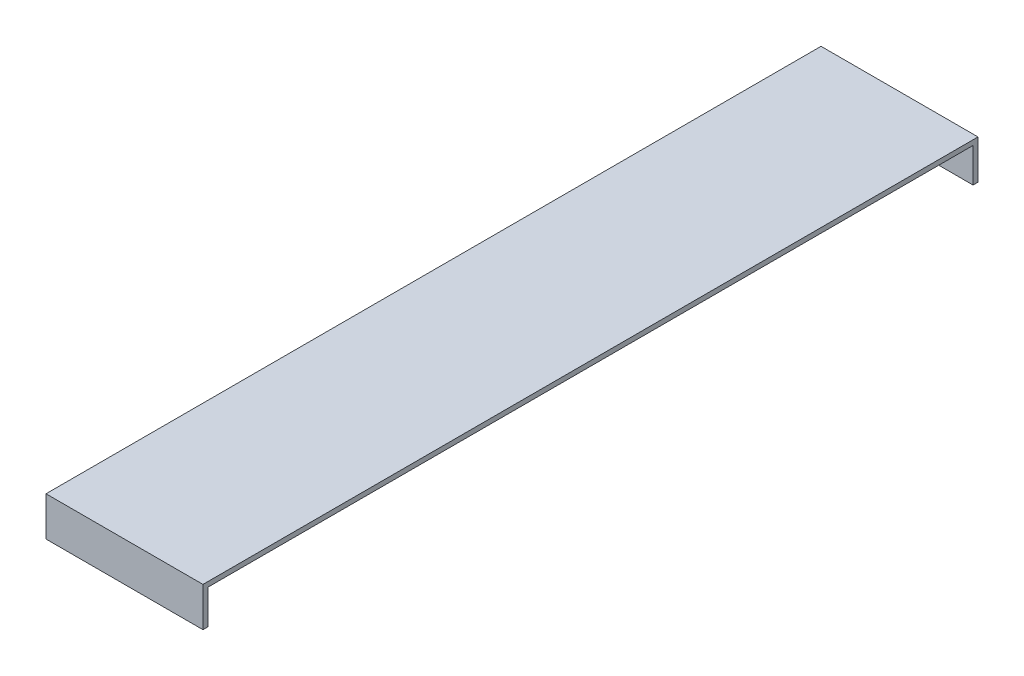
ISO-10303-21;
HEADER;
FILE_DESCRIPTION(('STEP AP214'),'2;1');
FILE_NAME('part.step','',(''),(''),'','','');
FILE_SCHEMA(('AUTOMOTIVE_DESIGN { 1 0 10303 214 1 1 1 1 }'));
ENDSEC;
DATA;
#1=APPLICATION_CONTEXT('core data for automotive mechanical design processes');
#2=APPLICATION_PROTOCOL_DEFINITION('international standard','automotive_design',2000,#1);
#3=PRODUCT_CONTEXT('',#1,'mechanical');
#4=PRODUCT('Part','Part','',(#3));
#5=PRODUCT_RELATED_PRODUCT_CATEGORY('part','',(#4));
#6=PRODUCT_DEFINITION_FORMATION('','',#4);
#7=PRODUCT_DEFINITION_CONTEXT('part definition',#1,'design');
#8=PRODUCT_DEFINITION('design','',#6,#7);
#9=PRODUCT_DEFINITION_SHAPE('','',#8);
#10=(LENGTH_UNIT() NAMED_UNIT(*) SI_UNIT(.MILLI.,.METRE.));
#11=(NAMED_UNIT(*) PLANE_ANGLE_UNIT() SI_UNIT($,.RADIAN.));
#12=(NAMED_UNIT(*) SI_UNIT($,.STERADIAN.) SOLID_ANGLE_UNIT());
#13=UNCERTAINTY_MEASURE_WITH_UNIT(LENGTH_MEASURE(1.E-05),#10,'distance_accuracy_value','');
#14=(GEOMETRIC_REPRESENTATION_CONTEXT(3) GLOBAL_UNCERTAINTY_ASSIGNED_CONTEXT((#13)) GLOBAL_UNIT_ASSIGNED_CONTEXT((#10,
#11,#12)) REPRESENTATION_CONTEXT('',''));
#15=CARTESIAN_POINT('',(0.,0.,0.));
#16=DIRECTION('',(0.,0.,1.));
#17=DIRECTION('',(1.,0.,0.));
#18=AXIS2_PLACEMENT_3D('',#15,#16,#17);
#19=CARTESIAN_POINT('',(101.6,0.,0.));
#20=DIRECTION('',(0.,0.,-1.));
#21=DIRECTION('',(0.,1.,0.));
#22=AXIS2_PLACEMENT_3D('',#19,#20,#21);
#23=PLANE('',#22);
#24=DIRECTION('',(0.,-1.,0.));
#25=VECTOR('',#24,1.);
#26=CARTESIAN_POINT('',(0.,0.,0.));
#27=LINE('',#26,#25);
#28=CARTESIAN_POINT('',(0.,0.,0.));
#29=VERTEX_POINT('',#28);
#30=CARTESIAN_POINT('',(0.,-25.4,0.));
#31=VERTEX_POINT('',#30);
#32=EDGE_CURVE('E129',#29,#31,#27,.T.);
#33=ORIENTED_EDGE('',*,*,#32,.T.);
#34=DIRECTION('',(-1.,0.,0.));
#35=VECTOR('',#34,1.);
#36=CARTESIAN_POINT('',(101.6,-25.4,0.));
#37=LINE('',#36,#35);
#38=CARTESIAN_POINT('',(101.6,-25.4,0.));
#39=VERTEX_POINT('',#38);
#40=EDGE_CURVE('E11',#39,#31,#37,.T.);
#41=ORIENTED_EDGE('',*,*,#40,.F.);
#42=DIRECTION('',(0.,-1.,0.));
#43=VECTOR('',#42,1.);
#44=CARTESIAN_POINT('',(101.6,0.,0.));
#45=LINE('',#44,#43);
#46=CARTESIAN_POINT('',(101.6,0.,0.));
#47=VERTEX_POINT('',#46);
#48=EDGE_CURVE('E143',#47,#39,#45,.T.);
#49=ORIENTED_EDGE('',*,*,#48,.F.);
#50=DIRECTION('',(-1.,0.,0.));
#51=VECTOR('',#50,1.);
#52=CARTESIAN_POINT('',(101.6,0.,0.));
#53=LINE('',#52,#51);
#54=EDGE_CURVE('E125',#47,#29,#53,.T.);
#55=ORIENTED_EDGE('',*,*,#54,.T.);
#56=EDGE_LOOP('',(#33,#41,#49,#55));
#57=FACE_BOUND('',#56,.T.);
#58=ADVANCED_FACE('F33',(#57),#23,.F.);
#59=CARTESIAN_POINT('',(101.6,-25.4,0.));
#60=DIRECTION('',(0.,1.,0.));
#61=DIRECTION('',(0.,0.,1.));
#62=AXIS2_PLACEMENT_3D('',#59,#60,#61);
#63=PLANE('',#62);
#64=DIRECTION('',(0.,0.,-1.));
#65=VECTOR('',#64,1.);
#66=CARTESIAN_POINT('',(0.,-25.4,0.));
#67=LINE('',#66,#65);
#68=CARTESIAN_POINT('',(0.,-25.4,-3.175));
#69=VERTEX_POINT('',#68);
#70=EDGE_CURVE('E132',#31,#69,#67,.T.);
#71=ORIENTED_EDGE('',*,*,#70,.T.);
#72=DIRECTION('',(-1.,0.,0.));
#73=VECTOR('',#72,1.);
#74=CARTESIAN_POINT('',(101.6,-25.4,-3.175));
#75=LINE('',#74,#73);
#76=CARTESIAN_POINT('',(101.6,-25.4,-3.175));
#77=VERTEX_POINT('',#76);
#78=EDGE_CURVE('E41',#77,#69,#75,.T.);
#79=ORIENTED_EDGE('',*,*,#78,.F.);
#80=DIRECTION('',(0.,0.,-1.));
#81=VECTOR('',#80,1.);
#82=CARTESIAN_POINT('',(101.6,-25.4,0.));
#83=LINE('',#82,#81);
#84=EDGE_CURVE('E92',#39,#77,#83,.T.);
#85=ORIENTED_EDGE('',*,*,#84,.F.);
#86=ORIENTED_EDGE('',*,*,#40,.T.);
#87=EDGE_LOOP('',(#71,#79,#85,#86));
#88=FACE_BOUND('',#87,.T.);
#89=ADVANCED_FACE('F178',(#88),#63,.F.);
#90=CARTESIAN_POINT('',(101.6,-3.175,-3.175));
#91=DIRECTION('',(0.,0.,1.));
#92=DIRECTION('',(0.,-1.,0.));
#93=AXIS2_PLACEMENT_3D('',#90,#91,#92);
#94=PLANE('',#93);
#95=DIRECTION('',(0.,1.,0.));
#96=VECTOR('',#95,1.);
#97=CARTESIAN_POINT('',(0.,-3.175,-3.175));
#98=LINE('',#97,#96);
#99=CARTESIAN_POINT('',(0.,-3.175,-3.175));
#100=VERTEX_POINT('',#99);
#101=EDGE_CURVE('E134',#69,#100,#98,.T.);
#102=ORIENTED_EDGE('',*,*,#101,.T.);
#103=DIRECTION('',(-1.,0.,0.));
#104=VECTOR('',#103,1.);
#105=CARTESIAN_POINT('',(101.6,-3.175,-3.175));
#106=LINE('',#105,#104);
#107=CARTESIAN_POINT('',(101.6,-3.175,-3.175));
#108=VERTEX_POINT('',#107);
#109=EDGE_CURVE('E150',#108,#100,#106,.T.);
#110=ORIENTED_EDGE('',*,*,#109,.F.);
#111=DIRECTION('',(0.,1.,0.));
#112=VECTOR('',#111,1.);
#113=CARTESIAN_POINT('',(101.6,-3.175,-3.175));
#114=LINE('',#113,#112);
#115=EDGE_CURVE('E158',#77,#108,#114,.T.);
#116=ORIENTED_EDGE('',*,*,#115,.F.);
#117=ORIENTED_EDGE('',*,*,#78,.T.);
#118=EDGE_LOOP('',(#102,#110,#116,#117));
#119=FACE_BOUND('',#118,.T.);
#120=ADVANCED_FACE('F156',(#119),#94,.F.);
#121=CARTESIAN_POINT('',(101.6,-3.175,-3.175));
#122=DIRECTION('',(0.,1.,0.));
#123=DIRECTION('',(0.,0.,1.));
#124=AXIS2_PLACEMENT_3D('',#121,#122,#123);
#125=PLANE('',#124);
#126=DIRECTION('',(0.,0.,-1.));
#127=VECTOR('',#126,1.);
#128=CARTESIAN_POINT('',(0.,-3.175,-3.175));
#129=LINE('',#128,#127);
#130=CARTESIAN_POINT('',(0.,-3.175,-498.475));
#131=VERTEX_POINT('',#130);
#132=EDGE_CURVE('E136',#100,#131,#129,.T.);
#133=ORIENTED_EDGE('',*,*,#132,.T.);
#134=DIRECTION('',(-1.,0.,0.));
#135=VECTOR('',#134,1.);
#136=CARTESIAN_POINT('',(101.6,-3.175,-498.475));
#137=LINE('',#136,#135);
#138=CARTESIAN_POINT('',(101.6,-3.175,-498.475));
#139=VERTEX_POINT('',#138);
#140=EDGE_CURVE('E147',#139,#131,#137,.T.);
#141=ORIENTED_EDGE('',*,*,#140,.F.);
#142=DIRECTION('',(0.,0.,-1.));
#143=VECTOR('',#142,1.);
#144=CARTESIAN_POINT('',(101.6,-3.175,-3.175));
#145=LINE('',#144,#143);
#146=EDGE_CURVE('E170',#108,#139,#145,.T.);
#147=ORIENTED_EDGE('',*,*,#146,.F.);
#148=ORIENTED_EDGE('',*,*,#109,.T.);
#149=EDGE_LOOP('',(#133,#141,#147,#148));
#150=FACE_BOUND('',#149,.T.);
#151=ADVANCED_FACE('F166',(#150),#125,.F.);
#152=CARTESIAN_POINT('',(101.6,-3.175,-498.475));
#153=DIRECTION('',(0.,0.,-1.));
#154=DIRECTION('',(-1.,0.,0.));
#155=AXIS2_PLACEMENT_3D('',#152,#153,#154);
#156=PLANE('',#155);
#157=DIRECTION('',(0.,-1.,0.));
#158=VECTOR('',#157,1.);
#159=CARTESIAN_POINT('',(0.,-3.175,-498.475));
#160=LINE('',#159,#158);
#161=CARTESIAN_POINT('',(0.,-25.4,-498.475));
#162=VERTEX_POINT('',#161);
#163=EDGE_CURVE('E138',#131,#162,#160,.T.);
#164=ORIENTED_EDGE('',*,*,#163,.T.);
#165=DIRECTION('',(-1.,0.,0.));
#166=VECTOR('',#165,1.);
#167=CARTESIAN_POINT('',(101.6,-25.4,-498.475));
#168=LINE('',#167,#166);
#169=CARTESIAN_POINT('',(101.6,-25.4,-498.475));
#170=VERTEX_POINT('',#169);
#171=EDGE_CURVE('E120',#170,#162,#168,.T.);
#172=ORIENTED_EDGE('',*,*,#171,.F.);
#173=DIRECTION('',(0.,-1.,0.));
#174=VECTOR('',#173,1.);
#175=CARTESIAN_POINT('',(101.6,-3.175,-498.475));
#176=LINE('',#175,#174);
#177=EDGE_CURVE('E111',#139,#170,#176,.T.);
#178=ORIENTED_EDGE('',*,*,#177,.F.);
#179=ORIENTED_EDGE('',*,*,#140,.T.);
#180=EDGE_LOOP('',(#164,#172,#178,#179));
#181=FACE_BOUND('',#180,.T.);
#182=ADVANCED_FACE('F169',(#181),#156,.F.);
#183=CARTESIAN_POINT('',(101.6,-25.4,-501.65));
#184=DIRECTION('',(0.,1.,0.));
#185=DIRECTION('',(0.,0.,1.));
#186=AXIS2_PLACEMENT_3D('',#183,#184,#185);
#187=PLANE('',#186);
#188=DIRECTION('',(0.,0.,-1.));
#189=VECTOR('',#188,1.);
#190=CARTESIAN_POINT('',(0.,-25.4,-501.65));
#191=LINE('',#190,#189);
#192=CARTESIAN_POINT('',(0.,-25.4,-501.65));
#193=VERTEX_POINT('',#192);
#194=EDGE_CURVE('E119',#162,#193,#191,.T.);
#195=ORIENTED_EDGE('',*,*,#194,.T.);
#196=DIRECTION('',(-1.,0.,0.));
#197=VECTOR('',#196,1.);
#198=CARTESIAN_POINT('',(101.6,-25.4,-501.65));
#199=LINE('',#198,#197);
#200=CARTESIAN_POINT('',(101.6,-25.4,-501.65));
#201=VERTEX_POINT('',#200);
#202=EDGE_CURVE('E116',#201,#193,#199,.T.);
#203=ORIENTED_EDGE('',*,*,#202,.F.);
#204=DIRECTION('',(0.,0.,-1.));
#205=VECTOR('',#204,1.);
#206=CARTESIAN_POINT('',(101.6,-25.4,-501.65));
#207=LINE('',#206,#205);
#208=EDGE_CURVE('E105',#170,#201,#207,.T.);
#209=ORIENTED_EDGE('',*,*,#208,.F.);
#210=ORIENTED_EDGE('',*,*,#171,.T.);
#211=EDGE_LOOP('',(#195,#203,#209,#210));
#212=FACE_BOUND('',#211,.T.);
#213=ADVANCED_FACE('F117',(#212),#187,.F.);
#214=CARTESIAN_POINT('',(101.6,0.,-501.65));
#215=DIRECTION('',(0.,0.,1.));
#216=DIRECTION('',(0.,-1.,0.));
#217=AXIS2_PLACEMENT_3D('',#214,#215,#216);
#218=PLANE('',#217);
#219=DIRECTION('',(0.,1.,0.));
#220=VECTOR('',#219,1.);
#221=CARTESIAN_POINT('',(0.,0.,-501.65));
#222=LINE('',#221,#220);
#223=CARTESIAN_POINT('',(0.,0.,-501.65));
#224=VERTEX_POINT('',#223);
#225=EDGE_CURVE('E78',#193,#224,#222,.T.);
#226=ORIENTED_EDGE('',*,*,#225,.T.);
#227=DIRECTION('',(-1.,0.,0.));
#228=VECTOR('',#227,1.);
#229=CARTESIAN_POINT('',(101.6,0.,-501.65));
#230=LINE('',#229,#228);
#231=CARTESIAN_POINT('',(101.6,0.,-501.65));
#232=VERTEX_POINT('',#231);
#233=EDGE_CURVE('E121',#232,#224,#230,.T.);
#234=ORIENTED_EDGE('',*,*,#233,.F.);
#235=DIRECTION('',(0.,1.,0.));
#236=VECTOR('',#235,1.);
#237=CARTESIAN_POINT('',(101.6,0.,-501.65));
#238=LINE('',#237,#236);
#239=EDGE_CURVE('E109',#201,#232,#238,.T.);
#240=ORIENTED_EDGE('',*,*,#239,.F.);
#241=ORIENTED_EDGE('',*,*,#202,.T.);
#242=EDGE_LOOP('',(#226,#234,#240,#241));
#243=FACE_BOUND('',#242,.T.);
#244=ADVANCED_FACE('F123',(#243),#218,.F.);
#245=CARTESIAN_POINT('',(101.6,0.,0.));
#246=DIRECTION('',(0.,-1.,0.));
#247=DIRECTION('',(0.,0.,-1.));
#248=AXIS2_PLACEMENT_3D('',#245,#246,#247);
#249=PLANE('',#248);
#250=DIRECTION('',(0.,0.,1.));
#251=VECTOR('',#250,1.);
#252=CARTESIAN_POINT('',(0.,0.,0.));
#253=LINE('',#252,#251);
#254=EDGE_CURVE('E84',#224,#29,#253,.T.);
#255=ORIENTED_EDGE('',*,*,#254,.T.);
#256=ORIENTED_EDGE('',*,*,#54,.F.);
#257=DIRECTION('',(0.,0.,1.));
#258=VECTOR('',#257,1.);
#259=CARTESIAN_POINT('',(101.6,0.,0.));
#260=LINE('',#259,#258);
#261=EDGE_CURVE('E49',#232,#47,#260,.T.);
#262=ORIENTED_EDGE('',*,*,#261,.F.);
#263=ORIENTED_EDGE('',*,*,#233,.T.);
#264=EDGE_LOOP('',(#255,#256,#262,#263));
#265=FACE_BOUND('',#264,.T.);
#266=ADVANCED_FACE('F194',(#265),#249,.F.);
#267=CARTESIAN_POINT('',(101.6,0.,0.));
#268=DIRECTION('',(1.,0.,0.));
#269=DIRECTION('',(0.,0.,-1.));
#270=AXIS2_PLACEMENT_3D('',#267,#268,#269);
#271=PLANE('',#270);
#272=ORIENTED_EDGE('',*,*,#48,.T.);
#273=ORIENTED_EDGE('',*,*,#84,.T.);
#274=ORIENTED_EDGE('',*,*,#115,.T.);
#275=ORIENTED_EDGE('',*,*,#146,.T.);
#276=ORIENTED_EDGE('',*,*,#177,.T.);
#277=ORIENTED_EDGE('',*,*,#208,.T.);
#278=ORIENTED_EDGE('',*,*,#239,.T.);
#279=ORIENTED_EDGE('',*,*,#261,.T.);
#280=EDGE_LOOP('',(#272,#273,#274,#275,#276,#277,#278,#279));
#281=FACE_BOUND('',#280,.T.);
#282=ADVANCED_FACE('F107',(#281),#271,.T.);
#283=CARTESIAN_POINT('',(0.,0.,0.));
#284=DIRECTION('',(1.,0.,0.));
#285=DIRECTION('',(0.,0.,-1.));
#286=AXIS2_PLACEMENT_3D('',#283,#284,#285);
#287=PLANE('',#286);
#288=ORIENTED_EDGE('',*,*,#32,.F.);
#289=ORIENTED_EDGE('',*,*,#254,.F.);
#290=ORIENTED_EDGE('',*,*,#225,.F.);
#291=ORIENTED_EDGE('',*,*,#194,.F.);
#292=ORIENTED_EDGE('',*,*,#163,.F.);
#293=ORIENTED_EDGE('',*,*,#132,.F.);
#294=ORIENTED_EDGE('',*,*,#101,.F.);
#295=ORIENTED_EDGE('',*,*,#70,.F.);
#296=EDGE_LOOP('',(#288,#289,#290,#291,#292,#293,#294,#295));
#297=FACE_BOUND('',#296,.T.);
#298=ADVANCED_FACE('F162',(#297),#287,.F.);
#299=CLOSED_SHELL('',(#58,#89,#120,#151,#182,#213,#244,#266,#282,#298));
#300=MANIFOLD_SOLID_BREP('B2',#299);
#301=ADVANCED_BREP_SHAPE_REPRESENTATION('',(#18,#300),#14);
#302=SHAPE_DEFINITION_REPRESENTATION(#9,#301);
ENDSEC;
END-ISO-10303-21;
